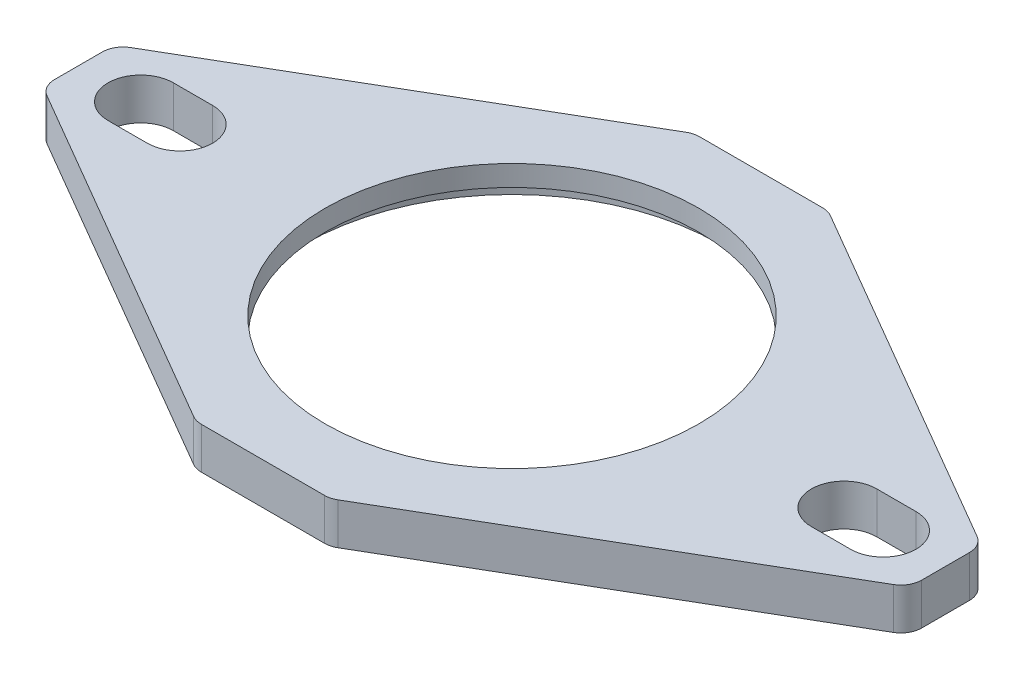
ISO-10303-21;
HEADER;
FILE_DESCRIPTION(('STEP AP214'),'2;1');
FILE_NAME('part.step','',(''),(''),'','','');
FILE_SCHEMA(('AUTOMOTIVE_DESIGN { 1 0 10303 214 1 1 1 1 }'));
ENDSEC;
DATA;
#1=APPLICATION_CONTEXT('core data for automotive mechanical design processes');
#2=APPLICATION_PROTOCOL_DEFINITION('international standard','automotive_design',2000,#1);
#3=PRODUCT_CONTEXT('',#1,'mechanical');
#4=PRODUCT('Part','Part','',(#3));
#5=PRODUCT_RELATED_PRODUCT_CATEGORY('part','',(#4));
#6=PRODUCT_DEFINITION_FORMATION('','',#4);
#7=PRODUCT_DEFINITION_CONTEXT('part definition',#1,'design');
#8=PRODUCT_DEFINITION('design','',#6,#7);
#9=PRODUCT_DEFINITION_SHAPE('','',#8);
#10=(LENGTH_UNIT() NAMED_UNIT(*) SI_UNIT(.MILLI.,.METRE.));
#11=(NAMED_UNIT(*) PLANE_ANGLE_UNIT() SI_UNIT($,.RADIAN.));
#12=(NAMED_UNIT(*) SI_UNIT($,.STERADIAN.) SOLID_ANGLE_UNIT());
#13=UNCERTAINTY_MEASURE_WITH_UNIT(LENGTH_MEASURE(1.E-05),#10,'distance_accuracy_value','');
#14=(GEOMETRIC_REPRESENTATION_CONTEXT(3) GLOBAL_UNCERTAINTY_ASSIGNED_CONTEXT((#13)) GLOBAL_UNIT_ASSIGNED_CONTEXT((#10,
#11,#12)) REPRESENTATION_CONTEXT('',''));
#15=CARTESIAN_POINT('',(0.,0.,0.));
#16=DIRECTION('',(0.,0.,1.));
#17=DIRECTION('',(1.,0.,0.));
#18=AXIS2_PLACEMENT_3D('',#15,#16,#17);
#19=CARTESIAN_POINT('',(4.71277753305894,-3.175,17.4625));
#20=DIRECTION('',(0.,1.,0.));
#21=DIRECTION('',(-1.,0.,0.));
#22=AXIS2_PLACEMENT_3D('',#19,#20,#21);
#23=CYLINDRICAL_SURFACE('',#22,1.5875);
#24=CARTESIAN_POINT('',(4.71277753305894,-3.175,17.4625));
#25=DIRECTION('',(0.,-1.,0.));
#26=DIRECTION('',(1.,0.,0.));
#27=AXIS2_PLACEMENT_3D('',#24,#25,#26);
#28=CIRCLE('',#27,1.5875);
#29=CARTESIAN_POINT('',(5.51147306377215,-3.175,18.8344481401346));
#30=VERTEX_POINT('',#29);
#31=CARTESIAN_POINT('',(4.71277753305894,-3.175,19.05));
#32=VERTEX_POINT('',#31);
#33=EDGE_CURVE('E391',#30,#32,#28,.T.);
#34=ORIENTED_EDGE('',*,*,#33,.F.);
#35=DIRECTION('',(0.,-1.,0.));
#36=VECTOR('',#35,1.);
#37=CARTESIAN_POINT('',(5.51147306377215,-3.175,18.8344481401346));
#38=LINE('',#37,#36);
#39=CARTESIAN_POINT('',(5.51147306377215,0.,18.8344481401346));
#40=VERTEX_POINT('',#39);
#41=EDGE_CURVE('E330',#40,#30,#38,.T.);
#42=ORIENTED_EDGE('',*,*,#41,.F.);
#43=CARTESIAN_POINT('',(4.71277753305894,0.,17.4625));
#44=DIRECTION('',(0.,1.,0.));
#45=DIRECTION('',(1.,0.,0.));
#46=AXIS2_PLACEMENT_3D('',#43,#44,#45);
#47=CIRCLE('',#46,1.5875);
#48=CARTESIAN_POINT('',(4.71277753305894,0.,19.05));
#49=VERTEX_POINT('',#48);
#50=EDGE_CURVE('E398',#49,#40,#47,.T.);
#51=ORIENTED_EDGE('',*,*,#50,.F.);
#52=DIRECTION('',(0.,1.,0.));
#53=VECTOR('',#52,1.);
#54=CARTESIAN_POINT('',(4.71277753305894,-3.175,19.05));
#55=LINE('',#54,#53);
#56=EDGE_CURVE('E324',#32,#49,#55,.T.);
#57=ORIENTED_EDGE('',*,*,#56,.F.);
#58=EDGE_LOOP('',(#34,#42,#51,#57));
#59=FACE_BOUND('',#58,.T.);
#60=ADVANCED_FACE('F16',(#59),#23,.T.);
#61=CARTESIAN_POINT('',(-4.71277753305894,-3.175,-17.4625));
#62=DIRECTION('',(0.,1.,0.));
#63=DIRECTION('',(-1.,0.,0.));
#64=AXIS2_PLACEMENT_3D('',#61,#62,#63);
#65=CYLINDRICAL_SURFACE('',#64,1.5875);
#66=CARTESIAN_POINT('',(-4.71277753305894,-3.175,-17.4625));
#67=DIRECTION('',(0.,-1.,0.));
#68=DIRECTION('',(1.,0.,0.));
#69=AXIS2_PLACEMENT_3D('',#66,#67,#68);
#70=CIRCLE('',#69,1.5875);
#71=CARTESIAN_POINT('',(-5.51147306377215,-3.175,-18.8344481401346));
#72=VERTEX_POINT('',#71);
#73=CARTESIAN_POINT('',(-4.71277753305894,-3.175,-19.05));
#74=VERTEX_POINT('',#73);
#75=EDGE_CURVE('E364',#72,#74,#70,.T.);
#76=ORIENTED_EDGE('',*,*,#75,.F.);
#77=DIRECTION('',(0.,-1.,0.));
#78=VECTOR('',#77,1.);
#79=CARTESIAN_POINT('',(-5.51147306377215,-3.175,-18.8344481401346));
#80=LINE('',#79,#78);
#81=CARTESIAN_POINT('',(-5.51147306377215,0.,-18.8344481401346));
#82=VERTEX_POINT('',#81);
#83=EDGE_CURVE('E311',#82,#72,#80,.T.);
#84=ORIENTED_EDGE('',*,*,#83,.F.);
#85=CARTESIAN_POINT('',(-4.71277753305894,0.,-17.4625));
#86=DIRECTION('',(0.,1.,0.));
#87=DIRECTION('',(1.,0.,0.));
#88=AXIS2_PLACEMENT_3D('',#85,#86,#87);
#89=CIRCLE('',#88,1.5875);
#90=CARTESIAN_POINT('',(-4.71277753305894,0.,-19.05));
#91=VERTEX_POINT('',#90);
#92=EDGE_CURVE('E10',#91,#82,#89,.T.);
#93=ORIENTED_EDGE('',*,*,#92,.F.);
#94=DIRECTION('',(0.,1.,0.));
#95=VECTOR('',#94,1.);
#96=CARTESIAN_POINT('',(-4.71277753305894,-3.175,-19.05));
#97=LINE('',#96,#95);
#98=EDGE_CURVE('E347',#74,#91,#97,.T.);
#99=ORIENTED_EDGE('',*,*,#98,.F.);
#100=EDGE_LOOP('',(#76,#84,#93,#99));
#101=FACE_BOUND('',#100,.T.);
#102=ADVANCED_FACE('F553',(#101),#65,.T.);
#103=CARTESIAN_POINT('',(4.71277753305894,-3.175,-17.4625));
#104=DIRECTION('',(0.,1.,0.));
#105=DIRECTION('',(-1.,0.,0.));
#106=AXIS2_PLACEMENT_3D('',#103,#104,#105);
#107=CYLINDRICAL_SURFACE('',#106,1.5875);
#108=CARTESIAN_POINT('',(4.71277753305894,-3.175,-17.4625));
#109=DIRECTION('',(0.,-1.,0.));
#110=DIRECTION('',(1.,0.,0.));
#111=AXIS2_PLACEMENT_3D('',#108,#109,#110);
#112=CIRCLE('',#111,1.5875);
#113=CARTESIAN_POINT('',(4.71277753305894,-3.175,-19.05));
#114=VERTEX_POINT('',#113);
#115=CARTESIAN_POINT('',(5.51147306377215,-3.175,-18.8344481401346));
#116=VERTEX_POINT('',#115);
#117=EDGE_CURVE('E420',#114,#116,#112,.T.);
#118=ORIENTED_EDGE('',*,*,#117,.F.);
#119=DIRECTION('',(0.,-1.,0.));
#120=VECTOR('',#119,1.);
#121=CARTESIAN_POINT('',(4.71277753305894,-3.175,-19.05));
#122=LINE('',#121,#120);
#123=CARTESIAN_POINT('',(4.71277753305894,0.,-19.05));
#124=VERTEX_POINT('',#123);
#125=EDGE_CURVE('E352',#124,#114,#122,.T.);
#126=ORIENTED_EDGE('',*,*,#125,.F.);
#127=CARTESIAN_POINT('',(4.71277753305894,0.,-17.4625));
#128=DIRECTION('',(0.,1.,0.));
#129=DIRECTION('',(1.,0.,0.));
#130=AXIS2_PLACEMENT_3D('',#127,#128,#129);
#131=CIRCLE('',#130,1.5875);
#132=CARTESIAN_POINT('',(5.51147306377215,0.,-18.8344481401346));
#133=VERTEX_POINT('',#132);
#134=EDGE_CURVE('E27',#133,#124,#131,.T.);
#135=ORIENTED_EDGE('',*,*,#134,.F.);
#136=DIRECTION('',(0.,1.,0.));
#137=VECTOR('',#136,1.);
#138=CARTESIAN_POINT('',(5.51147306377215,-3.175,-18.8344481401346));
#139=LINE('',#138,#137);
#140=EDGE_CURVE('E341',#116,#133,#139,.T.);
#141=ORIENTED_EDGE('',*,*,#140,.F.);
#142=EDGE_LOOP('',(#118,#126,#135,#141));
#143=FACE_BOUND('',#142,.T.);
#144=ADVANCED_FACE('F558',(#143),#107,.T.);
#145=CARTESIAN_POINT('',(31.5730633142474,-3.175,-1.82547292912974));
#146=DIRECTION('',(0.,1.,0.));
#147=DIRECTION('',(-1.,0.,0.));
#148=AXIS2_PLACEMENT_3D('',#145,#146,#147);
#149=CYLINDRICAL_SURFACE('',#148,1.5875);
#150=CARTESIAN_POINT('',(31.5730633142474,-3.175,-1.82547292912974));
#151=DIRECTION('',(0.,-1.,0.));
#152=DIRECTION('',(1.,0.,0.));
#153=AXIS2_PLACEMENT_3D('',#150,#151,#152);
#154=CIRCLE('',#153,1.5875);
#155=CARTESIAN_POINT('',(32.3717588449605,-3.175,-3.19742106926432));
#156=VERTEX_POINT('',#155);
#157=CARTESIAN_POINT('',(33.1605633142474,-3.175,-1.82547292912974));
#158=VERTEX_POINT('',#157);
#159=EDGE_CURVE('E405',#156,#158,#154,.T.);
#160=ORIENTED_EDGE('',*,*,#159,.F.);
#161=DIRECTION('',(0.,-1.,0.));
#162=VECTOR('',#161,1.);
#163=CARTESIAN_POINT('',(32.3717588449605,-3.175,-3.19742106926432));
#164=LINE('',#163,#162);
#165=CARTESIAN_POINT('',(32.3717588449605,0.,-3.19742106926432));
#166=VERTEX_POINT('',#165);
#167=EDGE_CURVE('E346',#166,#156,#164,.T.);
#168=ORIENTED_EDGE('',*,*,#167,.F.);
#169=CARTESIAN_POINT('',(31.5730633142474,0.,-1.82547292912974));
#170=DIRECTION('',(0.,1.,0.));
#171=DIRECTION('',(1.,0.,0.));
#172=AXIS2_PLACEMENT_3D('',#169,#170,#171);
#173=CIRCLE('',#172,1.5875);
#174=CARTESIAN_POINT('',(33.1605633142474,0.,-1.82547292912974));
#175=VERTEX_POINT('',#174);
#176=EDGE_CURVE('E413',#175,#166,#173,.T.);
#177=ORIENTED_EDGE('',*,*,#176,.F.);
#178=DIRECTION('',(0.,1.,0.));
#179=VECTOR('',#178,1.);
#180=CARTESIAN_POINT('',(33.1605633142474,-3.175,-1.82547292912974));
#181=LINE('',#180,#179);
#182=EDGE_CURVE('E427',#158,#175,#181,.T.);
#183=ORIENTED_EDGE('',*,*,#182,.F.);
#184=EDGE_LOOP('',(#160,#168,#177,#183));
#185=FACE_BOUND('',#184,.T.);
#186=ADVANCED_FACE('F564',(#185),#149,.T.);
#187=CARTESIAN_POINT('',(31.5730633142474,-3.175,1.82547292912974));
#188=DIRECTION('',(0.,1.,0.));
#189=DIRECTION('',(-1.,0.,0.));
#190=AXIS2_PLACEMENT_3D('',#187,#188,#189);
#191=CYLINDRICAL_SURFACE('',#190,1.5875);
#192=CARTESIAN_POINT('',(31.5730633142474,-3.175,1.82547292912974));
#193=DIRECTION('',(0.,-1.,0.));
#194=DIRECTION('',(1.,0.,0.));
#195=AXIS2_PLACEMENT_3D('',#192,#193,#194);
#196=CIRCLE('',#195,1.5875);
#197=CARTESIAN_POINT('',(33.1605633142474,-3.175,1.82547292912974));
#198=VERTEX_POINT('',#197);
#199=CARTESIAN_POINT('',(32.3717588449605,-3.175,3.19742106926432));
#200=VERTEX_POINT('',#199);
#201=EDGE_CURVE('E402',#198,#200,#196,.T.);
#202=ORIENTED_EDGE('',*,*,#201,.F.);
#203=DIRECTION('',(0.,-1.,0.));
#204=VECTOR('',#203,1.);
#205=CARTESIAN_POINT('',(33.1605633142474,-3.175,1.82547292912974));
#206=LINE('',#205,#204);
#207=CARTESIAN_POINT('',(33.1605633142474,0.,1.82547292912974));
#208=VERTEX_POINT('',#207);
#209=EDGE_CURVE('E340',#208,#198,#206,.T.);
#210=ORIENTED_EDGE('',*,*,#209,.F.);
#211=CARTESIAN_POINT('',(31.5730633142474,0.,1.82547292912974));
#212=DIRECTION('',(0.,1.,0.));
#213=DIRECTION('',(1.,0.,0.));
#214=AXIS2_PLACEMENT_3D('',#211,#212,#213);
#215=CIRCLE('',#214,1.5875);
#216=CARTESIAN_POINT('',(32.3717588449605,0.,3.19742106926432));
#217=VERTEX_POINT('',#216);
#218=EDGE_CURVE('E410',#217,#208,#215,.T.);
#219=ORIENTED_EDGE('',*,*,#218,.F.);
#220=DIRECTION('',(0.,1.,0.));
#221=VECTOR('',#220,1.);
#222=CARTESIAN_POINT('',(32.3717588449605,-3.175,3.19742106926432));
#223=LINE('',#222,#221);
#224=EDGE_CURVE('E335',#200,#217,#223,.T.);
#225=ORIENTED_EDGE('',*,*,#224,.F.);
#226=EDGE_LOOP('',(#202,#210,#219,#225));
#227=FACE_BOUND('',#226,.T.);
#228=ADVANCED_FACE('F568',(#227),#191,.T.);
#229=CARTESIAN_POINT('',(-4.71277753305894,-3.175,17.4625));
#230=DIRECTION('',(0.,1.,0.));
#231=DIRECTION('',(-1.,0.,0.));
#232=AXIS2_PLACEMENT_3D('',#229,#230,#231);
#233=CYLINDRICAL_SURFACE('',#232,1.5875);
#234=CARTESIAN_POINT('',(-4.71277753305894,-3.175,17.4625));
#235=DIRECTION('',(0.,-1.,0.));
#236=DIRECTION('',(1.,0.,0.));
#237=AXIS2_PLACEMENT_3D('',#234,#235,#236);
#238=CIRCLE('',#237,1.5875);
#239=CARTESIAN_POINT('',(-4.71277753305894,-3.175,19.05));
#240=VERTEX_POINT('',#239);
#241=CARTESIAN_POINT('',(-5.51147306377215,-3.175,18.8344481401346));
#242=VERTEX_POINT('',#241);
#243=EDGE_CURVE('E379',#240,#242,#238,.T.);
#244=ORIENTED_EDGE('',*,*,#243,.F.);
#245=DIRECTION('',(0.,-1.,0.));
#246=VECTOR('',#245,1.);
#247=CARTESIAN_POINT('',(-4.71277753305894,-3.175,19.05));
#248=LINE('',#247,#246);
#249=CARTESIAN_POINT('',(-4.71277753305894,0.,19.05));
#250=VERTEX_POINT('',#249);
#251=EDGE_CURVE('E329',#250,#240,#248,.T.);
#252=ORIENTED_EDGE('',*,*,#251,.F.);
#253=CARTESIAN_POINT('',(-4.71277753305894,0.,17.4625));
#254=DIRECTION('',(0.,1.,0.));
#255=DIRECTION('',(1.,0.,0.));
#256=AXIS2_PLACEMENT_3D('',#253,#254,#255);
#257=CIRCLE('',#256,1.5875);
#258=CARTESIAN_POINT('',(-5.51147306377215,0.,18.8344481401346));
#259=VERTEX_POINT('',#258);
#260=EDGE_CURVE('E386',#259,#250,#257,.T.);
#261=ORIENTED_EDGE('',*,*,#260,.F.);
#262=DIRECTION('',(0.,1.,0.));
#263=VECTOR('',#262,1.);
#264=CARTESIAN_POINT('',(-5.51147306377215,-3.175,18.8344481401346));
#265=LINE('',#264,#263);
#266=EDGE_CURVE('E291',#242,#259,#265,.T.);
#267=ORIENTED_EDGE('',*,*,#266,.F.);
#268=EDGE_LOOP('',(#244,#252,#261,#267));
#269=FACE_BOUND('',#268,.T.);
#270=ADVANCED_FACE('F572',(#269),#233,.T.);
#271=CARTESIAN_POINT('',(-31.5730633142474,-3.175,1.82547292912974));
#272=DIRECTION('',(0.,1.,0.));
#273=DIRECTION('',(-1.,0.,0.));
#274=AXIS2_PLACEMENT_3D('',#271,#272,#273);
#275=CYLINDRICAL_SURFACE('',#274,1.5875);
#276=CARTESIAN_POINT('',(-31.5730633142474,-3.175,1.82547292912974));
#277=DIRECTION('',(0.,-1.,0.));
#278=DIRECTION('',(1.,0.,0.));
#279=AXIS2_PLACEMENT_3D('',#276,#277,#278);
#280=CIRCLE('',#279,1.5875);
#281=CARTESIAN_POINT('',(-32.3717588449605,-3.175,3.19742106926432));
#282=VERTEX_POINT('',#281);
#283=CARTESIAN_POINT('',(-33.1605633142474,-3.175,1.82547292912974));
#284=VERTEX_POINT('',#283);
#285=EDGE_CURVE('E42',#282,#284,#280,.T.);
#286=ORIENTED_EDGE('',*,*,#285,.F.);
#287=DIRECTION('',(0.,-1.,0.));
#288=VECTOR('',#287,1.);
#289=CARTESIAN_POINT('',(-32.3717588449605,-3.175,3.19742106926432));
#290=LINE('',#289,#288);
#291=CARTESIAN_POINT('',(-32.3717588449605,0.,3.19742106926432));
#292=VERTEX_POINT('',#291);
#293=EDGE_CURVE('E323',#292,#282,#290,.T.);
#294=ORIENTED_EDGE('',*,*,#293,.F.);
#295=CARTESIAN_POINT('',(-31.5730633142474,0.,1.82547292912974));
#296=DIRECTION('',(0.,1.,0.));
#297=DIRECTION('',(1.,0.,0.));
#298=AXIS2_PLACEMENT_3D('',#295,#296,#297);
#299=CIRCLE('',#298,1.5875);
#300=CARTESIAN_POINT('',(-33.1605633142474,0.,1.82547292912974));
#301=VERTEX_POINT('',#300);
#302=EDGE_CURVE('E373',#301,#292,#299,.T.);
#303=ORIENTED_EDGE('',*,*,#302,.F.);
#304=DIRECTION('',(0.,1.,0.));
#305=VECTOR('',#304,1.);
#306=CARTESIAN_POINT('',(-33.1605633142474,-3.175,1.82547292912974));
#307=LINE('',#306,#305);
#308=EDGE_CURVE('E365',#284,#301,#307,.T.);
#309=ORIENTED_EDGE('',*,*,#308,.F.);
#310=EDGE_LOOP('',(#286,#294,#303,#309));
#311=FACE_BOUND('',#310,.T.);
#312=ADVANCED_FACE('F576',(#311),#275,.T.);
#313=CARTESIAN_POINT('',(-31.5730633142474,-3.175,-1.82547292912974));
#314=DIRECTION('',(0.,1.,0.));
#315=DIRECTION('',(-1.,0.,0.));
#316=AXIS2_PLACEMENT_3D('',#313,#314,#315);
#317=CYLINDRICAL_SURFACE('',#316,1.5875);
#318=CARTESIAN_POINT('',(-31.5730633142474,-3.175,-1.82547292912974));
#319=DIRECTION('',(0.,-1.,0.));
#320=DIRECTION('',(1.,0.,0.));
#321=AXIS2_PLACEMENT_3D('',#318,#319,#320);
#322=CIRCLE('',#321,1.5875);
#323=CARTESIAN_POINT('',(-33.1605633142474,-3.175,-1.82547292912974));
#324=VERTEX_POINT('',#323);
#325=CARTESIAN_POINT('',(-32.3717588449605,-3.175,-3.19742106926432));
#326=VERTEX_POINT('',#325);
#327=EDGE_CURVE('E361',#324,#326,#322,.T.);
#328=ORIENTED_EDGE('',*,*,#327,.F.);
#329=DIRECTION('',(0.,-1.,0.));
#330=VECTOR('',#329,1.);
#331=CARTESIAN_POINT('',(-33.1605633142474,-3.175,-1.82547292912974));
#332=LINE('',#331,#330);
#333=CARTESIAN_POINT('',(-33.1605633142474,0.,-1.82547292912974));
#334=VERTEX_POINT('',#333);
#335=EDGE_CURVE('E317',#334,#324,#332,.T.);
#336=ORIENTED_EDGE('',*,*,#335,.F.);
#337=CARTESIAN_POINT('',(-31.5730633142474,0.,-1.82547292912974));
#338=DIRECTION('',(0.,1.,0.));
#339=DIRECTION('',(1.,0.,0.));
#340=AXIS2_PLACEMENT_3D('',#337,#338,#339);
#341=CIRCLE('',#340,1.5875);
#342=CARTESIAN_POINT('',(-32.3717588449605,0.,-3.19742106926432));
#343=VERTEX_POINT('',#342);
#344=EDGE_CURVE('E370',#343,#334,#341,.T.);
#345=ORIENTED_EDGE('',*,*,#344,.F.);
#346=DIRECTION('',(0.,1.,0.));
#347=VECTOR('',#346,1.);
#348=CARTESIAN_POINT('',(-32.3717588449605,-3.175,-3.19742106926432));
#349=LINE('',#348,#347);
#350=EDGE_CURVE('E312',#326,#343,#349,.T.);
#351=ORIENTED_EDGE('',*,*,#350,.F.);
#352=EDGE_LOOP('',(#328,#336,#345,#351));
#353=FACE_BOUND('',#352,.T.);
#354=ADVANCED_FACE('F580',(#353),#317,.T.);
#355=CARTESIAN_POINT('',(0.,-1.5875,0.));
#356=DIRECTION('',(0.,-1.,0.));
#357=DIRECTION('',(1.,0.,0.));
#358=AXIS2_PLACEMENT_3D('',#355,#356,#357);
#359=PLANE('',#358);
#360=CARTESIAN_POINT('',(0.,-1.5875,0.));
#361=DIRECTION('',(0.,-1.,0.));
#362=DIRECTION('',(1.,0.,0.));
#363=AXIS2_PLACEMENT_3D('',#360,#361,#362);
#364=CIRCLE('',#363,15.875);
#365=CARTESIAN_POINT('',(15.875,-1.5875,0.));
#366=VERTEX_POINT('',#365);
#367=EDGE_CURVE('E356',#366,#366,#364,.T.);
#368=ORIENTED_EDGE('',*,*,#367,.T.);
#369=EDGE_LOOP('',(#368));
#370=FACE_BOUND('',#369,.T.);
#371=CARTESIAN_POINT('',(0.,-1.5875,0.));
#372=DIRECTION('',(0.,-1.,0.));
#373=DIRECTION('',(1.,0.,0.));
#374=AXIS2_PLACEMENT_3D('',#371,#372,#373);
#375=CIRCLE('',#374,14.2925);
#376=CARTESIAN_POINT('',(14.2925,-1.5875,0.));
#377=VERTEX_POINT('',#376);
#378=EDGE_CURVE('E306',#377,#377,#375,.T.);
#379=ORIENTED_EDGE('',*,*,#378,.F.);
#380=EDGE_LOOP('',(#379));
#381=FACE_BOUND('',#380,.T.);
#382=ADVANCED_FACE('F584',(#370,#381),#359,.T.);
#383=CARTESIAN_POINT('',(0.,0.,0.));
#384=DIRECTION('',(0.,-1.,0.));
#385=DIRECTION('',(1.,0.,0.));
#386=AXIS2_PLACEMENT_3D('',#383,#384,#385);
#387=PLANE('',#386);
#388=DIRECTION('',(-0.86421930087218,0.,0.503115294937453));
#389=VECTOR('',#388,1.);
#390=CARTESIAN_POINT('',(-9.58434636855847,0.,-16.463377681615));
#391=LINE('',#390,#389);
#392=EDGE_CURVE('E307',#82,#343,#391,.T.);
#393=ORIENTED_EDGE('',*,*,#392,.T.);
#394=ORIENTED_EDGE('',*,*,#344,.T.);
#395=DIRECTION('',(0.,0.,1.));
#396=VECTOR('',#395,1.);
#397=CARTESIAN_POINT('',(-33.1605633142474,0.,0.));
#398=LINE('',#397,#396);
#399=EDGE_CURVE('E313',#334,#301,#398,.T.);
#400=ORIENTED_EDGE('',*,*,#399,.T.);
#401=ORIENTED_EDGE('',*,*,#302,.T.);
#402=DIRECTION('',(0.86421930087218,0.,0.503115294937453));
#403=VECTOR('',#402,1.);
#404=CARTESIAN_POINT('',(-9.58434636855847,0.,16.463377681615));
#405=LINE('',#404,#403);
#406=EDGE_CURVE('E319',#292,#259,#405,.T.);
#407=ORIENTED_EDGE('',*,*,#406,.T.);
#408=ORIENTED_EDGE('',*,*,#260,.T.);
#409=DIRECTION('',(1.,0.,0.));
#410=VECTOR('',#409,1.);
#411=CARTESIAN_POINT('',(0.,0.,19.05));
#412=LINE('',#411,#410);
#413=EDGE_CURVE('E325',#250,#49,#412,.T.);
#414=ORIENTED_EDGE('',*,*,#413,.T.);
#415=ORIENTED_EDGE('',*,*,#50,.T.);
#416=DIRECTION('',(0.86421930087218,0.,-0.503115294937453));
#417=VECTOR('',#416,1.);
#418=CARTESIAN_POINT('',(9.58434636855847,0.,16.463377681615));
#419=LINE('',#418,#417);
#420=EDGE_CURVE('E331',#40,#217,#419,.T.);
#421=ORIENTED_EDGE('',*,*,#420,.T.);
#422=ORIENTED_EDGE('',*,*,#218,.T.);
#423=DIRECTION('',(0.,0.,-1.));
#424=VECTOR('',#423,1.);
#425=CARTESIAN_POINT('',(33.1605633142474,0.,0.));
#426=LINE('',#425,#424);
#427=EDGE_CURVE('E336',#208,#175,#426,.T.);
#428=ORIENTED_EDGE('',*,*,#427,.T.);
#429=ORIENTED_EDGE('',*,*,#176,.T.);
#430=DIRECTION('',(-0.86421930087218,0.,-0.503115294937453));
#431=VECTOR('',#430,1.);
#432=CARTESIAN_POINT('',(9.58434636855847,0.,-16.463377681615));
#433=LINE('',#432,#431);
#434=EDGE_CURVE('E342',#166,#133,#433,.T.);
#435=ORIENTED_EDGE('',*,*,#434,.T.);
#436=ORIENTED_EDGE('',*,*,#134,.T.);
#437=DIRECTION('',(-1.,0.,0.));
#438=VECTOR('',#437,1.);
#439=CARTESIAN_POINT('',(0.,0.,-19.05));
#440=LINE('',#439,#438);
#441=EDGE_CURVE('E348',#124,#91,#440,.T.);
#442=ORIENTED_EDGE('',*,*,#441,.T.);
#443=ORIENTED_EDGE('',*,*,#92,.T.);
#444=EDGE_LOOP('',(#393,#394,#400,#401,#407,#408,#414,#415,#421,#422,#428,#429,#435,#436,#442,#443));
#445=FACE_BOUND('',#444,.T.);
#446=CARTESIAN_POINT('',(0.,0.,0.));
#447=DIRECTION('',(0.,-1.,0.));
#448=DIRECTION('',(1.,0.,0.));
#449=AXIS2_PLACEMENT_3D('',#446,#447,#448);
#450=CIRCLE('',#449,14.2925);
#451=CARTESIAN_POINT('',(14.2925,0.,0.));
#452=VERTEX_POINT('',#451);
#453=EDGE_CURVE('E301',#452,#452,#450,.T.);
#454=ORIENTED_EDGE('',*,*,#453,.T.);
#455=EDGE_LOOP('',(#454));
#456=FACE_BOUND('',#455,.T.);
#457=CARTESIAN_POINT('',(-25.4,0.,0.));
#458=DIRECTION('',(0.,-1.,0.));
#459=DIRECTION('',(1.,0.,0.));
#460=AXIS2_PLACEMENT_3D('',#457,#458,#459);
#461=CIRCLE('',#460,2.5);
#462=CARTESIAN_POINT('',(-25.4,0.,-2.5));
#463=VERTEX_POINT('',#462);
#464=CARTESIAN_POINT('',(-25.4,0.,2.5));
#465=VERTEX_POINT('',#464);
#466=EDGE_CURVE('E286',#463,#465,#461,.T.);
#467=ORIENTED_EDGE('',*,*,#466,.T.);
#468=DIRECTION('',(1.,0.,0.));
#469=VECTOR('',#468,1.);
#470=CARTESIAN_POINT('',(0.,0.,2.4999999999999));
#471=LINE('',#470,#469);
#472=CARTESIAN_POINT('',(-28.3980633142474,0.,2.5));
#473=VERTEX_POINT('',#472);
#474=EDGE_CURVE('E460',#473,#465,#471,.T.);
#475=ORIENTED_EDGE('',*,*,#474,.F.);
#476=CARTESIAN_POINT('',(-28.3980633142474,0.,0.));
#477=DIRECTION('',(0.,-1.,0.));
#478=DIRECTION('',(1.,0.,0.));
#479=AXIS2_PLACEMENT_3D('',#476,#477,#478);
#480=CIRCLE('',#479,2.5);
#481=CARTESIAN_POINT('',(-28.3980633142474,0.,-2.5));
#482=VERTEX_POINT('',#481);
#483=EDGE_CURVE('E292',#473,#482,#480,.T.);
#484=ORIENTED_EDGE('',*,*,#483,.T.);
#485=DIRECTION('',(1.,0.,0.));
#486=VECTOR('',#485,1.);
#487=CARTESIAN_POINT('',(0.,0.,-2.50000000000008));
#488=LINE('',#487,#486);
#489=EDGE_CURVE('E296',#482,#463,#488,.T.);
#490=ORIENTED_EDGE('',*,*,#489,.T.);
#491=EDGE_LOOP('',(#467,#475,#484,#490));
#492=FACE_BOUND('',#491,.T.);
#493=CARTESIAN_POINT('',(25.4,0.,0.));
#494=DIRECTION('',(0.,-1.,0.));
#495=DIRECTION('',(1.,0.,0.));
#496=AXIS2_PLACEMENT_3D('',#493,#494,#495);
#497=CIRCLE('',#496,2.5);
#498=CARTESIAN_POINT('',(25.4,0.,2.5));
#499=VERTEX_POINT('',#498);
#500=CARTESIAN_POINT('',(25.4,0.,-2.5));
#501=VERTEX_POINT('',#500);
#502=EDGE_CURVE('E513',#499,#501,#497,.T.);
#503=ORIENTED_EDGE('',*,*,#502,.T.);
#504=DIRECTION('',(-1.,0.,0.));
#505=VECTOR('',#504,1.);
#506=CARTESIAN_POINT('',(0.,0.,-2.50000000000008));
#507=LINE('',#506,#505);
#508=CARTESIAN_POINT('',(28.3980633142474,0.,-2.49999999999997));
#509=VERTEX_POINT('',#508);
#510=EDGE_CURVE('E256',#509,#501,#507,.T.);
#511=ORIENTED_EDGE('',*,*,#510,.F.);
#512=CARTESIAN_POINT('',(28.3980633142474,0.,0.));
#513=DIRECTION('',(0.,-1.,0.));
#514=DIRECTION('',(1.,0.,0.));
#515=AXIS2_PLACEMENT_3D('',#512,#513,#514);
#516=CIRCLE('',#515,2.5);
#517=CARTESIAN_POINT('',(28.3980633142474,0.,2.5));
#518=VERTEX_POINT('',#517);
#519=EDGE_CURVE('E249',#509,#518,#516,.T.);
#520=ORIENTED_EDGE('',*,*,#519,.T.);
#521=DIRECTION('',(-1.,0.,0.));
#522=VECTOR('',#521,1.);
#523=CARTESIAN_POINT('',(0.,0.,2.4999999999999));
#524=LINE('',#523,#522);
#525=EDGE_CURVE('E253',#518,#499,#524,.T.);
#526=ORIENTED_EDGE('',*,*,#525,.T.);
#527=EDGE_LOOP('',(#503,#511,#520,#526));
#528=FACE_BOUND('',#527,.T.);
#529=ADVANCED_FACE('F251',(#445,#456,#492,#528),#387,.F.);
#530=CARTESIAN_POINT('',(0.,-3.175,0.));
#531=DIRECTION('',(0.,-1.,0.));
#532=DIRECTION('',(1.,0.,0.));
#533=AXIS2_PLACEMENT_3D('',#530,#531,#532);
#534=PLANE('',#533);
#535=DIRECTION('',(0.,0.,1.));
#536=VECTOR('',#535,1.);
#537=CARTESIAN_POINT('',(-33.1605633142474,-3.175,0.));
#538=LINE('',#537,#536);
#539=EDGE_CURVE('E369',#324,#284,#538,.T.);
#540=ORIENTED_EDGE('',*,*,#539,.F.);
#541=ORIENTED_EDGE('',*,*,#327,.T.);
#542=DIRECTION('',(-0.86421930087218,0.,0.503115294937453));
#543=VECTOR('',#542,1.);
#544=CARTESIAN_POINT('',(-9.58434636855847,-3.175,-16.463377681615));
#545=LINE('',#544,#543);
#546=EDGE_CURVE('E305',#72,#326,#545,.T.);
#547=ORIENTED_EDGE('',*,*,#546,.F.);
#548=ORIENTED_EDGE('',*,*,#75,.T.);
#549=DIRECTION('',(-1.,0.,0.));
#550=VECTOR('',#549,1.);
#551=CARTESIAN_POINT('',(0.,-3.175,-19.05));
#552=LINE('',#551,#550);
#553=EDGE_CURVE('E436',#114,#74,#552,.T.);
#554=ORIENTED_EDGE('',*,*,#553,.F.);
#555=ORIENTED_EDGE('',*,*,#117,.T.);
#556=DIRECTION('',(-0.86421930087218,0.,-0.503115294937453));
#557=VECTOR('',#556,1.);
#558=CARTESIAN_POINT('',(9.58434636855847,-3.175,-16.463377681615));
#559=LINE('',#558,#557);
#560=EDGE_CURVE('E424',#156,#116,#559,.T.);
#561=ORIENTED_EDGE('',*,*,#560,.F.);
#562=ORIENTED_EDGE('',*,*,#159,.T.);
#563=DIRECTION('',(0.,0.,-1.));
#564=VECTOR('',#563,1.);
#565=CARTESIAN_POINT('',(33.1605633142474,-3.175,0.));
#566=LINE('',#565,#564);
#567=EDGE_CURVE('E409',#198,#158,#566,.T.);
#568=ORIENTED_EDGE('',*,*,#567,.F.);
#569=ORIENTED_EDGE('',*,*,#201,.T.);
#570=DIRECTION('',(0.86421930087218,0.,-0.503115294937453));
#571=VECTOR('',#570,1.);
#572=CARTESIAN_POINT('',(9.58434636855847,-3.175,16.463377681615));
#573=LINE('',#572,#571);
#574=EDGE_CURVE('E417',#30,#200,#573,.T.);
#575=ORIENTED_EDGE('',*,*,#574,.F.);
#576=ORIENTED_EDGE('',*,*,#33,.T.);
#577=DIRECTION('',(1.,0.,0.));
#578=VECTOR('',#577,1.);
#579=CARTESIAN_POINT('',(0.,-3.175,19.05));
#580=LINE('',#579,#578);
#581=EDGE_CURVE('E395',#240,#32,#580,.T.);
#582=ORIENTED_EDGE('',*,*,#581,.F.);
#583=ORIENTED_EDGE('',*,*,#243,.T.);
#584=DIRECTION('',(0.86421930087218,0.,0.503115294937453));
#585=VECTOR('',#584,1.);
#586=CARTESIAN_POINT('',(-9.58434636855847,-3.175,16.463377681615));
#587=LINE('',#586,#585);
#588=EDGE_CURVE('E383',#282,#242,#587,.T.);
#589=ORIENTED_EDGE('',*,*,#588,.F.);
#590=ORIENTED_EDGE('',*,*,#285,.T.);
#591=EDGE_LOOP('',(#540,#541,#547,#548,#554,#555,#561,#562,#568,#569,#575,#576,#582,#583,#589,#590));
#592=FACE_BOUND('',#591,.T.);
#593=CARTESIAN_POINT('',(-25.4,-3.175,0.));
#594=DIRECTION('',(0.,-1.,0.));
#595=DIRECTION('',(1.,0.,0.));
#596=AXIS2_PLACEMENT_3D('',#593,#594,#595);
#597=CIRCLE('',#596,2.5);
#598=CARTESIAN_POINT('',(-25.4,-3.175,-2.5));
#599=VERTEX_POINT('',#598);
#600=CARTESIAN_POINT('',(-25.4,-3.175,2.5));
#601=VERTEX_POINT('',#600);
#602=EDGE_CURVE('E472',#599,#601,#597,.T.);
#603=ORIENTED_EDGE('',*,*,#602,.F.);
#604=DIRECTION('',(1.,0.,0.));
#605=VECTOR('',#604,1.);
#606=CARTESIAN_POINT('',(0.,-3.175,-2.50000000000008));
#607=LINE('',#606,#605);
#608=CARTESIAN_POINT('',(-28.3980633142474,-3.175,-2.5));
#609=VERTEX_POINT('',#608);
#610=EDGE_CURVE('E222',#609,#599,#607,.T.);
#611=ORIENTED_EDGE('',*,*,#610,.F.);
#612=CARTESIAN_POINT('',(-28.3980633142474,-3.175,0.));
#613=DIRECTION('',(0.,-1.,0.));
#614=DIRECTION('',(1.,0.,0.));
#615=AXIS2_PLACEMENT_3D('',#612,#613,#614);
#616=CIRCLE('',#615,2.5);
#617=CARTESIAN_POINT('',(-28.3980633142474,-3.175,2.5));
#618=VERTEX_POINT('',#617);
#619=EDGE_CURVE('E295',#618,#609,#616,.T.);
#620=ORIENTED_EDGE('',*,*,#619,.F.);
#621=DIRECTION('',(1.,0.,0.));
#622=VECTOR('',#621,1.);
#623=CARTESIAN_POINT('',(0.,-3.175,2.4999999999999));
#624=LINE('',#623,#622);
#625=EDGE_CURVE('E207',#618,#601,#624,.T.);
#626=ORIENTED_EDGE('',*,*,#625,.T.);
#627=EDGE_LOOP('',(#603,#611,#620,#626));
#628=FACE_BOUND('',#627,.T.);
#629=CARTESIAN_POINT('',(25.4,-3.175,0.));
#630=DIRECTION('',(0.,-1.,0.));
#631=DIRECTION('',(1.,0.,0.));
#632=AXIS2_PLACEMENT_3D('',#629,#630,#631);
#633=CIRCLE('',#632,2.5);
#634=CARTESIAN_POINT('',(25.4,-3.175,2.5));
#635=VERTEX_POINT('',#634);
#636=CARTESIAN_POINT('',(25.4,-3.175,-2.5));
#637=VERTEX_POINT('',#636);
#638=EDGE_CURVE('E515',#635,#637,#633,.T.);
#639=ORIENTED_EDGE('',*,*,#638,.F.);
#640=DIRECTION('',(-1.,0.,0.));
#641=VECTOR('',#640,1.);
#642=CARTESIAN_POINT('',(0.,-3.175,2.4999999999999));
#643=LINE('',#642,#641);
#644=CARTESIAN_POINT('',(28.3980633142474,-3.175,2.5));
#645=VERTEX_POINT('',#644);
#646=EDGE_CURVE('E262',#645,#635,#643,.T.);
#647=ORIENTED_EDGE('',*,*,#646,.F.);
#648=CARTESIAN_POINT('',(28.3980633142474,-3.175,0.));
#649=DIRECTION('',(0.,-1.,0.));
#650=DIRECTION('',(1.,0.,0.));
#651=AXIS2_PLACEMENT_3D('',#648,#649,#650);
#652=CIRCLE('',#651,2.5);
#653=CARTESIAN_POINT('',(28.3980633142474,-3.175,-2.49999999999997));
#654=VERTEX_POINT('',#653);
#655=EDGE_CURVE('E268',#654,#645,#652,.T.);
#656=ORIENTED_EDGE('',*,*,#655,.F.);
#657=DIRECTION('',(-1.,0.,0.));
#658=VECTOR('',#657,1.);
#659=CARTESIAN_POINT('',(0.,-3.175,-2.50000000000008));
#660=LINE('',#659,#658);
#661=EDGE_CURVE('E318',#654,#637,#660,.T.);
#662=ORIENTED_EDGE('',*,*,#661,.T.);
#663=EDGE_LOOP('',(#639,#647,#656,#662));
#664=FACE_BOUND('',#663,.T.);
#665=CARTESIAN_POINT('',(0.,-3.175,0.));
#666=DIRECTION('',(0.,-1.,0.));
#667=DIRECTION('',(1.,0.,0.));
#668=AXIS2_PLACEMENT_3D('',#665,#666,#667);
#669=CIRCLE('',#668,15.875);
#670=CARTESIAN_POINT('',(15.875,-3.175,0.));
#671=VERTEX_POINT('',#670);
#672=EDGE_CURVE('E360',#671,#671,#669,.T.);
#673=ORIENTED_EDGE('',*,*,#672,.F.);
#674=EDGE_LOOP('',(#673));
#675=FACE_BOUND('',#674,.T.);
#676=ADVANCED_FACE('F536',(#592,#628,#664,#675),#534,.T.);
#677=CARTESIAN_POINT('',(-33.1605633142474,-3.175,0.));
#678=DIRECTION('',(-1.,0.,0.));
#679=DIRECTION('',(0.,-1.,0.));
#680=AXIS2_PLACEMENT_3D('',#677,#678,#679);
#681=PLANE('',#680);
#682=ORIENTED_EDGE('',*,*,#399,.F.);
#683=ORIENTED_EDGE('',*,*,#335,.T.);
#684=ORIENTED_EDGE('',*,*,#539,.T.);
#685=ORIENTED_EDGE('',*,*,#308,.T.);
#686=EDGE_LOOP('',(#682,#683,#684,#685));
#687=FACE_BOUND('',#686,.T.);
#688=ADVANCED_FACE('F542',(#687),#681,.T.);
#689=CARTESIAN_POINT('',(0.,-3.175,-2.50000000000008));
#690=DIRECTION('',(0.,0.,1.));
#691=DIRECTION('',(-1.,0.,0.));
#692=AXIS2_PLACEMENT_3D('',#689,#690,#691);
#693=PLANE('',#692);
#694=ORIENTED_EDGE('',*,*,#510,.T.);
#695=DIRECTION('',(0.,1.,0.));
#696=VECTOR('',#695,1.);
#697=CARTESIAN_POINT('',(25.4,-3.175,-2.50000000000008));
#698=LINE('',#697,#696);
#699=EDGE_CURVE('E276',#637,#501,#698,.T.);
#700=ORIENTED_EDGE('',*,*,#699,.F.);
#701=ORIENTED_EDGE('',*,*,#661,.F.);
#702=DIRECTION('',(0.,1.,0.));
#703=VECTOR('',#702,1.);
#704=CARTESIAN_POINT('',(28.3980633142474,-3.175,-2.50000000000007));
#705=LINE('',#704,#703);
#706=EDGE_CURVE('E261',#654,#509,#705,.T.);
#707=ORIENTED_EDGE('',*,*,#706,.T.);
#708=EDGE_LOOP('',(#694,#700,#701,#707));
#709=FACE_BOUND('',#708,.T.);
#710=ADVANCED_FACE('F540',(#709),#693,.T.);
#711=CARTESIAN_POINT('',(0.,-3.175,2.4999999999999));
#712=DIRECTION('',(0.,0.,-1.));
#713=DIRECTION('',(1.,0.,0.));
#714=AXIS2_PLACEMENT_3D('',#711,#712,#713);
#715=PLANE('',#714);
#716=ORIENTED_EDGE('',*,*,#474,.T.);
#717=DIRECTION('',(0.,1.,0.));
#718=VECTOR('',#717,1.);
#719=CARTESIAN_POINT('',(-25.4,-3.175,2.4999999999999));
#720=LINE('',#719,#718);
#721=EDGE_CURVE('E300',#601,#465,#720,.T.);
#722=ORIENTED_EDGE('',*,*,#721,.F.);
#723=ORIENTED_EDGE('',*,*,#625,.F.);
#724=DIRECTION('',(0.,1.,0.));
#725=VECTOR('',#724,1.);
#726=CARTESIAN_POINT('',(-28.3980633142474,-3.175,2.49999999999989));
#727=LINE('',#726,#725);
#728=EDGE_CURVE('E20',#618,#473,#727,.T.);
#729=ORIENTED_EDGE('',*,*,#728,.T.);
#730=EDGE_LOOP('',(#716,#722,#723,#729));
#731=FACE_BOUND('',#730,.T.);
#732=ADVANCED_FACE('F18',(#731),#715,.T.);
#733=CARTESIAN_POINT('',(28.3980633142474,-3.175,0.));
#734=DIRECTION('',(0.,1.,0.));
#735=DIRECTION('',(-1.,0.,0.));
#736=AXIS2_PLACEMENT_3D('',#733,#734,#735);
#737=CYLINDRICAL_SURFACE('',#736,2.5);
#738=ORIENTED_EDGE('',*,*,#519,.F.);
#739=ORIENTED_EDGE('',*,*,#706,.F.);
#740=ORIENTED_EDGE('',*,*,#655,.T.);
#741=DIRECTION('',(0.,1.,0.));
#742=VECTOR('',#741,1.);
#743=CARTESIAN_POINT('',(28.3980633142474,-3.175,2.5));
#744=LINE('',#743,#742);
#745=EDGE_CURVE('E265',#645,#518,#744,.T.);
#746=ORIENTED_EDGE('',*,*,#745,.T.);
#747=EDGE_LOOP('',(#738,#739,#740,#746));
#748=FACE_BOUND('',#747,.T.);
#749=ADVANCED_FACE('F266',(#748),#737,.F.);
#750=CARTESIAN_POINT('',(0.,-3.175,2.4999999999999));
#751=DIRECTION('',(0.,0.,-1.));
#752=DIRECTION('',(1.,0.,0.));
#753=AXIS2_PLACEMENT_3D('',#750,#751,#752);
#754=PLANE('',#753);
#755=ORIENTED_EDGE('',*,*,#525,.F.);
#756=ORIENTED_EDGE('',*,*,#745,.F.);
#757=ORIENTED_EDGE('',*,*,#646,.T.);
#758=DIRECTION('',(0.,1.,0.));
#759=VECTOR('',#758,1.);
#760=CARTESIAN_POINT('',(25.4,-3.175,2.5));
#761=LINE('',#760,#759);
#762=EDGE_CURVE('E274',#635,#499,#761,.T.);
#763=ORIENTED_EDGE('',*,*,#762,.T.);
#764=EDGE_LOOP('',(#755,#756,#757,#763));
#765=FACE_BOUND('',#764,.T.);
#766=ADVANCED_FACE('F272',(#765),#754,.T.);
#767=CARTESIAN_POINT('',(0.,-3.175,-2.50000000000008));
#768=DIRECTION('',(0.,0.,1.));
#769=DIRECTION('',(-1.,0.,0.));
#770=AXIS2_PLACEMENT_3D('',#767,#768,#769);
#771=PLANE('',#770);
#772=ORIENTED_EDGE('',*,*,#489,.F.);
#773=DIRECTION('',(0.,1.,0.));
#774=VECTOR('',#773,1.);
#775=CARTESIAN_POINT('',(-28.3980633142474,-3.175,-2.5));
#776=LINE('',#775,#774);
#777=EDGE_CURVE('E299',#609,#482,#776,.T.);
#778=ORIENTED_EDGE('',*,*,#777,.F.);
#779=ORIENTED_EDGE('',*,*,#610,.T.);
#780=DIRECTION('',(0.,1.,0.));
#781=VECTOR('',#780,1.);
#782=CARTESIAN_POINT('',(-25.4,-3.175,-2.5));
#783=LINE('',#782,#781);
#784=EDGE_CURVE('E290',#599,#463,#783,.T.);
#785=ORIENTED_EDGE('',*,*,#784,.T.);
#786=EDGE_LOOP('',(#772,#778,#779,#785));
#787=FACE_BOUND('',#786,.T.);
#788=ADVANCED_FACE('F598',(#787),#771,.T.);
#789=CARTESIAN_POINT('',(-25.4,-3.175,0.));
#790=DIRECTION('',(0.,1.,0.));
#791=DIRECTION('',(-1.,0.,0.));
#792=AXIS2_PLACEMENT_3D('',#789,#790,#791);
#793=CYLINDRICAL_SURFACE('',#792,2.5);
#794=ORIENTED_EDGE('',*,*,#466,.F.);
#795=ORIENTED_EDGE('',*,*,#784,.F.);
#796=ORIENTED_EDGE('',*,*,#602,.T.);
#797=ORIENTED_EDGE('',*,*,#721,.T.);
#798=EDGE_LOOP('',(#794,#795,#796,#797));
#799=FACE_BOUND('',#798,.T.);
#800=ADVANCED_FACE('F605',(#799),#793,.F.);
#801=CARTESIAN_POINT('',(-9.58434636855847,-3.175,16.463377681615));
#802=DIRECTION('',(-0.503115294937453,0.,0.86421930087218));
#803=DIRECTION('',(-0.86421930087218,0.,-0.503115294937453));
#804=AXIS2_PLACEMENT_3D('',#801,#802,#803);
#805=PLANE('',#804);
#806=ORIENTED_EDGE('',*,*,#406,.F.);
#807=ORIENTED_EDGE('',*,*,#293,.T.);
#808=ORIENTED_EDGE('',*,*,#588,.T.);
#809=ORIENTED_EDGE('',*,*,#266,.T.);
#810=EDGE_LOOP('',(#806,#807,#808,#809));
#811=FACE_BOUND('',#810,.T.);
#812=ADVANCED_FACE('F608',(#811),#805,.T.);
#813=CARTESIAN_POINT('',(0.,-3.175,19.05));
#814=DIRECTION('',(0.,0.,1.));
#815=DIRECTION('',(0.,-1.,0.));
#816=AXIS2_PLACEMENT_3D('',#813,#814,#815);
#817=PLANE('',#816);
#818=ORIENTED_EDGE('',*,*,#413,.F.);
#819=ORIENTED_EDGE('',*,*,#251,.T.);
#820=ORIENTED_EDGE('',*,*,#581,.T.);
#821=ORIENTED_EDGE('',*,*,#56,.T.);
#822=EDGE_LOOP('',(#818,#819,#820,#821));
#823=FACE_BOUND('',#822,.T.);
#824=ADVANCED_FACE('F611',(#823),#817,.T.);
#825=CARTESIAN_POINT('',(9.58434636855847,-3.175,16.463377681615));
#826=DIRECTION('',(0.503115294937453,0.,0.86421930087218));
#827=DIRECTION('',(-0.86421930087218,0.,0.503115294937453));
#828=AXIS2_PLACEMENT_3D('',#825,#826,#827);
#829=PLANE('',#828);
#830=ORIENTED_EDGE('',*,*,#574,.T.);
#831=ORIENTED_EDGE('',*,*,#224,.T.);
#832=ORIENTED_EDGE('',*,*,#420,.F.);
#833=ORIENTED_EDGE('',*,*,#41,.T.);
#834=EDGE_LOOP('',(#830,#831,#832,#833));
#835=FACE_BOUND('',#834,.T.);
#836=ADVANCED_FACE('F615',(#835),#829,.T.);
#837=CARTESIAN_POINT('',(33.1605633142474,-3.175,0.));
#838=DIRECTION('',(1.,0.,0.));
#839=DIRECTION('',(0.,1.,0.));
#840=AXIS2_PLACEMENT_3D('',#837,#838,#839);
#841=PLANE('',#840);
#842=ORIENTED_EDGE('',*,*,#427,.F.);
#843=ORIENTED_EDGE('',*,*,#209,.T.);
#844=ORIENTED_EDGE('',*,*,#567,.T.);
#845=ORIENTED_EDGE('',*,*,#182,.T.);
#846=EDGE_LOOP('',(#842,#843,#844,#845));
#847=FACE_BOUND('',#846,.T.);
#848=ADVANCED_FACE('F619',(#847),#841,.T.);
#849=CARTESIAN_POINT('',(9.58434636855847,-3.175,-16.463377681615));
#850=DIRECTION('',(0.503115294937453,0.,-0.86421930087218));
#851=DIRECTION('',(0.86421930087218,0.,0.503115294937453));
#852=AXIS2_PLACEMENT_3D('',#849,#850,#851);
#853=PLANE('',#852);
#854=ORIENTED_EDGE('',*,*,#434,.F.);
#855=ORIENTED_EDGE('',*,*,#167,.T.);
#856=ORIENTED_EDGE('',*,*,#560,.T.);
#857=ORIENTED_EDGE('',*,*,#140,.T.);
#858=EDGE_LOOP('',(#854,#855,#856,#857));
#859=FACE_BOUND('',#858,.T.);
#860=ADVANCED_FACE('F623',(#859),#853,.T.);
#861=CARTESIAN_POINT('',(0.,-3.175,-19.05));
#862=DIRECTION('',(0.,0.,-1.));
#863=DIRECTION('',(0.,1.,0.));
#864=AXIS2_PLACEMENT_3D('',#861,#862,#863);
#865=PLANE('',#864);
#866=ORIENTED_EDGE('',*,*,#441,.F.);
#867=ORIENTED_EDGE('',*,*,#125,.T.);
#868=ORIENTED_EDGE('',*,*,#553,.T.);
#869=ORIENTED_EDGE('',*,*,#98,.T.);
#870=EDGE_LOOP('',(#866,#867,#868,#869));
#871=FACE_BOUND('',#870,.T.);
#872=ADVANCED_FACE('F627',(#871),#865,.T.);
#873=CARTESIAN_POINT('',(-9.58434636855847,-3.175,-16.463377681615));
#874=DIRECTION('',(-0.503115294937453,0.,-0.86421930087218));
#875=DIRECTION('',(0.86421930087218,0.,-0.503115294937453));
#876=AXIS2_PLACEMENT_3D('',#873,#874,#875);
#877=PLANE('',#876);
#878=ORIENTED_EDGE('',*,*,#546,.T.);
#879=ORIENTED_EDGE('',*,*,#350,.T.);
#880=ORIENTED_EDGE('',*,*,#392,.F.);
#881=ORIENTED_EDGE('',*,*,#83,.T.);
#882=EDGE_LOOP('',(#878,#879,#880,#881));
#883=FACE_BOUND('',#882,.T.);
#884=ADVANCED_FACE('F631',(#883),#877,.T.);
#885=CARTESIAN_POINT('',(0.,-3.175,0.));
#886=DIRECTION('',(0.,1.,0.));
#887=DIRECTION('',(-1.,0.,0.));
#888=AXIS2_PLACEMENT_3D('',#885,#886,#887);
#889=CYLINDRICAL_SURFACE('',#888,14.2925);
#890=ORIENTED_EDGE('',*,*,#453,.F.);
#891=EDGE_LOOP('',(#890));
#892=FACE_BOUND('',#891,.T.);
#893=ORIENTED_EDGE('',*,*,#378,.T.);
#894=EDGE_LOOP('',(#893));
#895=FACE_BOUND('',#894,.T.);
#896=ADVANCED_FACE('F635',(#892,#895),#889,.F.);
#897=CARTESIAN_POINT('',(-28.3980633142474,-3.175,0.));
#898=DIRECTION('',(0.,1.,0.));
#899=DIRECTION('',(-1.,0.,0.));
#900=AXIS2_PLACEMENT_3D('',#897,#898,#899);
#901=CYLINDRICAL_SURFACE('',#900,2.5);
#902=ORIENTED_EDGE('',*,*,#619,.T.);
#903=ORIENTED_EDGE('',*,*,#777,.T.);
#904=ORIENTED_EDGE('',*,*,#483,.F.);
#905=ORIENTED_EDGE('',*,*,#728,.F.);
#906=EDGE_LOOP('',(#902,#903,#904,#905));
#907=FACE_BOUND('',#906,.T.);
#908=ADVANCED_FACE('F602',(#907),#901,.F.);
#909=CARTESIAN_POINT('',(25.4,-3.175,0.));
#910=DIRECTION('',(0.,1.,0.));
#911=DIRECTION('',(-1.,0.,0.));
#912=AXIS2_PLACEMENT_3D('',#909,#910,#911);
#913=CYLINDRICAL_SURFACE('',#912,2.5);
#914=ORIENTED_EDGE('',*,*,#638,.T.);
#915=ORIENTED_EDGE('',*,*,#699,.T.);
#916=ORIENTED_EDGE('',*,*,#502,.F.);
#917=ORIENTED_EDGE('',*,*,#762,.F.);
#918=EDGE_LOOP('',(#914,#915,#916,#917));
#919=FACE_BOUND('',#918,.T.);
#920=ADVANCED_FACE('F535',(#919),#913,.F.);
#921=CARTESIAN_POINT('',(0.,-1.5875,0.));
#922=DIRECTION('',(0.,-1.,0.));
#923=DIRECTION('',(1.,0.,0.));
#924=AXIS2_PLACEMENT_3D('',#921,#922,#923);
#925=CYLINDRICAL_SURFACE('',#924,15.875);
#926=ORIENTED_EDGE('',*,*,#672,.T.);
#927=EDGE_LOOP('',(#926));
#928=FACE_BOUND('',#927,.T.);
#929=ORIENTED_EDGE('',*,*,#367,.F.);
#930=EDGE_LOOP('',(#929));
#931=FACE_BOUND('',#930,.T.);
#932=ADVANCED_FACE('F601',(#928,#931),#925,.F.);
#933=CLOSED_SHELL('',(#60,#102,#144,#186,#228,#270,#312,#354,#382,#529,#676,#688,#710,#732,#749,
#766,#788,#800,#812,#824,#836,#848,#860,#872,#884,#896,#908,#920,#932));
#934=MANIFOLD_SOLID_BREP('B1',#933);
#935=ADVANCED_BREP_SHAPE_REPRESENTATION('',(#18,#934),#14);
#936=SHAPE_DEFINITION_REPRESENTATION(#9,#935);
ENDSEC;
END-ISO-10303-21;
